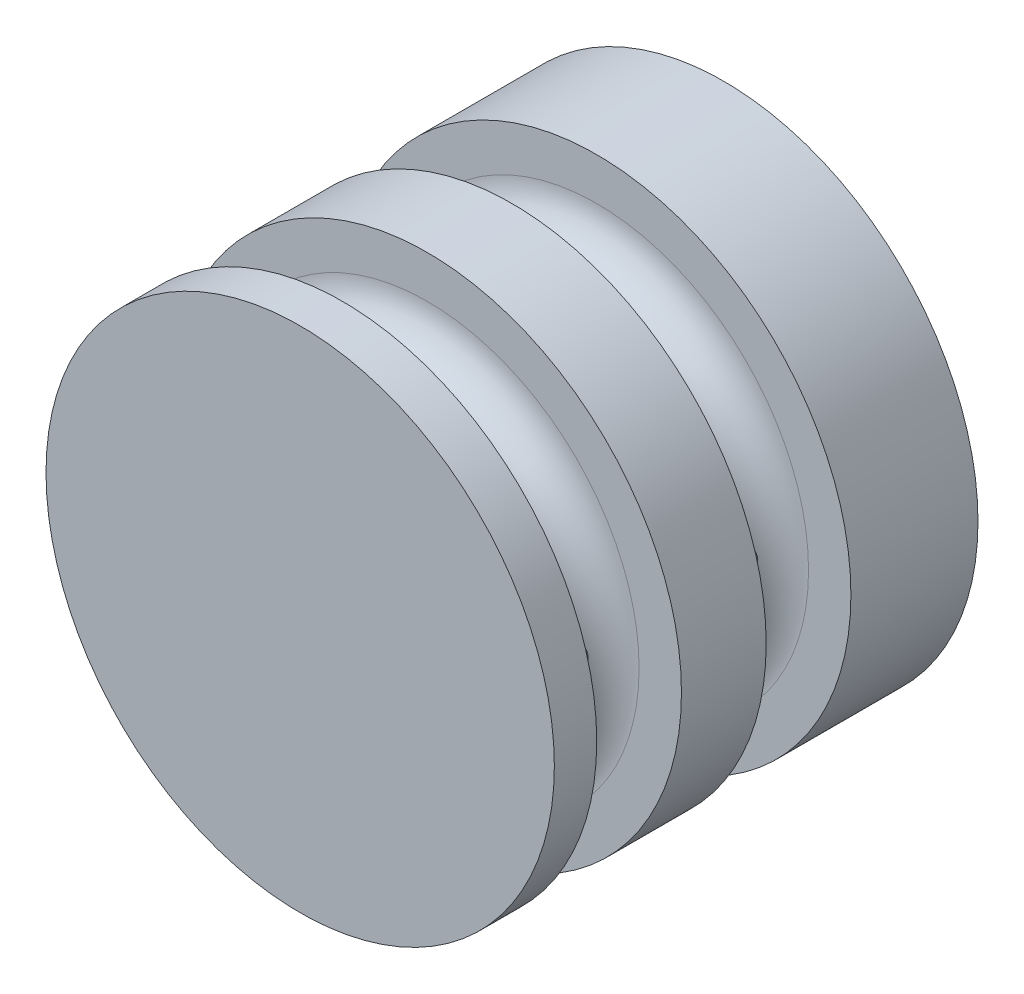
ISO-10303-21;
HEADER;
FILE_DESCRIPTION(('STEP AP214'),'2;1');
FILE_NAME('part.step','',(''),(''),'','','');
FILE_SCHEMA(('AUTOMOTIVE_DESIGN { 1 0 10303 214 1 1 1 1 }'));
ENDSEC;
DATA;
#1=APPLICATION_CONTEXT('core data for automotive mechanical design processes');
#2=APPLICATION_PROTOCOL_DEFINITION('international standard','automotive_design',2000,#1);
#3=PRODUCT_CONTEXT('',#1,'mechanical');
#4=PRODUCT('Part','Part','',(#3));
#5=PRODUCT_RELATED_PRODUCT_CATEGORY('part','',(#4));
#6=PRODUCT_DEFINITION_FORMATION('','',#4);
#7=PRODUCT_DEFINITION_CONTEXT('part definition',#1,'design');
#8=PRODUCT_DEFINITION('design','',#6,#7);
#9=PRODUCT_DEFINITION_SHAPE('','',#8);
#10=(LENGTH_UNIT() NAMED_UNIT(*) SI_UNIT(.MILLI.,.METRE.));
#11=(NAMED_UNIT(*) PLANE_ANGLE_UNIT() SI_UNIT($,.RADIAN.));
#12=(NAMED_UNIT(*) SI_UNIT($,.STERADIAN.) SOLID_ANGLE_UNIT());
#13=UNCERTAINTY_MEASURE_WITH_UNIT(LENGTH_MEASURE(1.E-05),#10,'distance_accuracy_value','');
#14=(GEOMETRIC_REPRESENTATION_CONTEXT(3) GLOBAL_UNCERTAINTY_ASSIGNED_CONTEXT((#13)) GLOBAL_UNIT_ASSIGNED_CONTEXT((#10,
#11,#12)) REPRESENTATION_CONTEXT('',''));
#15=CARTESIAN_POINT('',(0.,0.,0.));
#16=DIRECTION('',(0.,0.,1.));
#17=DIRECTION('',(1.,0.,0.));
#18=AXIS2_PLACEMENT_3D('',#15,#16,#17);
#19=CARTESIAN_POINT('',(0.,0.,-25.));
#20=DIRECTION('',(0.,0.,1.));
#21=DIRECTION('',(1.,0.,0.));
#22=AXIS2_PLACEMENT_3D('',#19,#20,#21);
#23=PLANE('',#22);
#24=CARTESIAN_POINT('',(0.,0.,-25.));
#25=DIRECTION('',(0.,0.,1.));
#26=DIRECTION('',(1.,0.,0.));
#27=AXIS2_PLACEMENT_3D('',#24,#25,#26);
#28=CIRCLE('',#27,3.5);
#29=CARTESIAN_POINT('',(3.5,0.,-25.));
#30=VERTEX_POINT('',#29);
#31=EDGE_CURVE('E220',#30,#30,#28,.T.);
#32=ORIENTED_EDGE('',*,*,#31,.T.);
#33=EDGE_LOOP('',(#32));
#34=FACE_BOUND('',#33,.T.);
#35=CARTESIAN_POINT('',(0.,7.,-25.));
#36=DIRECTION('',(0.,0.,-1.));
#37=DIRECTION('',(-1.,0.,0.));
#38=AXIS2_PLACEMENT_3D('',#35,#36,#37);
#39=CIRCLE('',#38,1.59999999999999);
#40=CARTESIAN_POINT('',(-1.59999999999999,7.,-25.));
#41=VERTEX_POINT('',#40);
#42=EDGE_CURVE('E87',#41,#41,#39,.T.);
#43=ORIENTED_EDGE('',*,*,#42,.F.);
#44=EDGE_LOOP('',(#43));
#45=FACE_BOUND('',#44,.T.);
#46=CARTESIAN_POINT('',(-7.,0.,-25.));
#47=DIRECTION('',(0.,0.,-1.));
#48=DIRECTION('',(-1.,0.,0.));
#49=AXIS2_PLACEMENT_3D('',#46,#47,#48);
#50=CIRCLE('',#49,1.59999999999999);
#51=CARTESIAN_POINT('',(-8.59999999999999,0.,-25.));
#52=VERTEX_POINT('',#51);
#53=EDGE_CURVE('E86',#52,#52,#50,.T.);
#54=ORIENTED_EDGE('',*,*,#53,.F.);
#55=EDGE_LOOP('',(#54));
#56=FACE_BOUND('',#55,.T.);
#57=CARTESIAN_POINT('',(0.,-7.,-25.));
#58=DIRECTION('',(0.,0.,-1.));
#59=DIRECTION('',(-1.,0.,0.));
#60=AXIS2_PLACEMENT_3D('',#57,#58,#59);
#61=CIRCLE('',#60,1.59999999999999);
#62=CARTESIAN_POINT('',(-1.59999999999999,-7.,-25.));
#63=VERTEX_POINT('',#62);
#64=EDGE_CURVE('E102',#63,#63,#61,.T.);
#65=ORIENTED_EDGE('',*,*,#64,.F.);
#66=EDGE_LOOP('',(#65));
#67=FACE_BOUND('',#66,.T.);
#68=CARTESIAN_POINT('',(7.,0.,-25.));
#69=DIRECTION('',(0.,0.,-1.));
#70=DIRECTION('',(-1.,0.,0.));
#71=AXIS2_PLACEMENT_3D('',#68,#69,#70);
#72=CIRCLE('',#71,1.59999999999999);
#73=CARTESIAN_POINT('',(5.40000000000001,0.,-25.));
#74=VERTEX_POINT('',#73);
#75=EDGE_CURVE('E110',#74,#74,#72,.T.);
#76=ORIENTED_EDGE('',*,*,#75,.F.);
#77=EDGE_LOOP('',(#76));
#78=FACE_BOUND('',#77,.T.);
#79=CARTESIAN_POINT('',(0.,0.,-25.));
#80=DIRECTION('',(0.,0.,1.));
#81=DIRECTION('',(1.,0.,0.));
#82=AXIS2_PLACEMENT_3D('',#79,#80,#81);
#83=CIRCLE('',#82,15.);
#84=CARTESIAN_POINT('',(15.,0.,-25.));
#85=VERTEX_POINT('',#84);
#86=EDGE_CURVE('E11',#85,#85,#83,.T.);
#87=ORIENTED_EDGE('',*,*,#86,.F.);
#88=EDGE_LOOP('',(#87));
#89=FACE_BOUND('',#88,.T.);
#90=ADVANCED_FACE('F47',(#34,#45,#56,#67,#78,#89),#23,.F.);
#91=CARTESIAN_POINT('',(0.,0.,0.));
#92=DIRECTION('',(0.,0.,1.));
#93=DIRECTION('',(1.,0.,0.));
#94=AXIS2_PLACEMENT_3D('',#91,#92,#93);
#95=CYLINDRICAL_SURFACE('',#94,15.);
#96=ORIENTED_EDGE('',*,*,#86,.T.);
#97=EDGE_LOOP('',(#96));
#98=FACE_BOUND('',#97,.T.);
#99=CARTESIAN_POINT('',(0.,0.,-17.5));
#100=DIRECTION('',(0.,0.,1.));
#101=DIRECTION('',(1.,0.,0.));
#102=AXIS2_PLACEMENT_3D('',#99,#100,#101);
#103=CIRCLE('',#102,15.);
#104=CARTESIAN_POINT('',(15.,0.,-17.5));
#105=VERTEX_POINT('',#104);
#106=EDGE_CURVE('E61',#105,#105,#103,.T.);
#107=ORIENTED_EDGE('',*,*,#106,.F.);
#108=EDGE_LOOP('',(#107));
#109=FACE_BOUND('',#108,.T.);
#110=ADVANCED_FACE('F201',(#98,#109),#95,.T.);
#111=CARTESIAN_POINT('',(0.,0.,-17.5));
#112=DIRECTION('',(0.,0.,1.));
#113=DIRECTION('',(1.,0.,0.));
#114=AXIS2_PLACEMENT_3D('',#111,#112,#113);
#115=PLANE('',#114);
#116=ORIENTED_EDGE('',*,*,#106,.T.);
#117=EDGE_LOOP('',(#116));
#118=FACE_BOUND('',#117,.T.);
#119=CARTESIAN_POINT('',(0.,0.,-17.5));
#120=DIRECTION('',(0.,0.,1.));
#121=DIRECTION('',(1.,0.,0.));
#122=AXIS2_PLACEMENT_3D('',#119,#120,#121);
#123=CIRCLE('',#122,12.5);
#124=CARTESIAN_POINT('',(12.5,0.,-17.5));
#125=VERTEX_POINT('',#124);
#126=EDGE_CURVE('E147',#125,#125,#123,.T.);
#127=ORIENTED_EDGE('',*,*,#126,.F.);
#128=EDGE_LOOP('',(#127));
#129=FACE_BOUND('',#128,.T.);
#130=ADVANCED_FACE('F197',(#118,#129),#115,.T.);
#131=CARTESIAN_POINT('',(0.,0.,-15.));
#132=DIRECTION('',(0.,0.,1.));
#133=DIRECTION('',(1.,0.,0.));
#134=AXIS2_PLACEMENT_3D('',#131,#132,#133);
#135=TOROIDAL_SURFACE('',#134,12.5,2.5);
#136=CARTESIAN_POINT('',(-10.331563461529,-0.762303138128262,-16.2918567744142));
#137=CARTESIAN_POINT('',(-10.3571768917839,-0.702863928352168,-16.3269303746499));
#138=CARTESIAN_POINT('',(-10.3813468920579,-0.640497040593573,-16.3582069846842));
#139=CARTESIAN_POINT('',(-10.4245730773328,-0.510382569111914,-16.4122579798436));
#140=CARTESIAN_POINT('',(-10.4436243288663,-0.442629875430599,-16.4350241708062));
#141=CARTESIAN_POINT('',(-10.4743540959138,-0.302243964609681,-16.4710321218813));
#142=CARTESIAN_POINT('',(-10.4859634604527,-0.22957171812525,-16.4841847045559));
#143=CARTESIAN_POINT('',(-10.4995837498731,-0.0822562940621653,-16.4995651765924));
#144=CARTESIAN_POINT('',(-10.5016112218422,-0.0076167382391645,-16.5018118995988));
#145=CARTESIAN_POINT('',(-10.4961115234413,0.131640892244681,-16.4956365135555));
#146=CARTESIAN_POINT('',(-10.489722452848,0.196368286283706,-16.4884854776984));
#147=CARTESIAN_POINT('',(-10.4702062729504,0.323394060495705,-16.4661459913901));
#148=CARTESIAN_POINT('',(-10.457071608093,0.385689632484336,-16.4509485277665));
#149=CARTESIAN_POINT('',(-10.4211670246832,0.523453579264165,-16.4080322349446));
#150=CARTESIAN_POINT('',(-10.3967327530326,0.597761677154352,-16.3780054985274));
#151=CARTESIAN_POINT('',(-10.3426855129699,0.739236612318296,-16.307592319013));
#152=CARTESIAN_POINT('',(-10.3130646512393,0.806392310372203,-16.2671900413139));
#153=CARTESIAN_POINT('',(-10.251113002849,0.934180039673199,-16.1762521831512));
#154=CARTESIAN_POINT('',(-10.2187422155484,0.994668372422415,-16.1255429387364));
#155=CARTESIAN_POINT('',(-10.1545592654337,1.10711433010181,-16.0151367367607));
#156=CARTESIAN_POINT('',(-10.1227469268653,1.15907468354865,-15.9554426656488));
#157=CARTESIAN_POINT('',(-10.0631785805986,1.25219248189157,-15.8294372498299));
#158=CARTESIAN_POINT('',(-10.0353305685515,1.29362349093601,-15.7633731903876));
#159=CARTESIAN_POINT('',(-9.98506610669139,1.3663177029197,-15.6239670286912));
#160=CARTESIAN_POINT('',(-9.96264372165722,1.39759202942915,-15.5506330042029));
#161=CARTESIAN_POINT('',(-9.92840994508656,1.44456780319142,-15.4097193506219));
#162=CARTESIAN_POINT('',(-9.91550412776364,1.4619131292107,-15.3429576279622));
#163=CARTESIAN_POINT('',(-9.89649935252837,1.48729393283197,-15.206749310848));
#164=CARTESIAN_POINT('',(-9.89039556812976,1.49533601184927,-15.1373046563571));
#165=CARTESIAN_POINT('',(-9.88562413360547,1.50163116566931,-14.997557335023));
#166=CARTESIAN_POINT('',(-9.88697274213881,1.49986283737152,-14.9272531263376));
#167=CARTESIAN_POINT('',(-9.89699688356039,1.48660245496729,-14.7880978607954));
#168=CARTESIAN_POINT('',(-9.90567495840769,1.47510702736732,-14.7192473165818));
#169=CARTESIAN_POINT('',(-9.92914975451083,1.4435037868733,-14.586696486354));
#170=CARTESIAN_POINT('',(-9.94377635074125,1.42363491953707,-14.5229076440803));
#171=CARTESIAN_POINT('',(-9.97789945931796,1.37621583002469,-14.3996714620731));
#172=CARTESIAN_POINT('',(-9.99739710704999,1.34866381682191,-14.3402251387115));
#173=CARTESIAN_POINT('',(-10.0428060711243,1.28251318372049,-14.2185994721005));
#174=CARTESIAN_POINT('',(-10.0692296247525,1.24291987511486,-14.1571553910749));
#175=CARTESIAN_POINT('',(-10.1246244885247,1.15592073588388,-14.0412997879019));
#176=CARTESIAN_POINT('',(-10.1535988876716,1.10850537055327,-13.986896994984));
#177=CARTESIAN_POINT('',(-10.2178589955819,0.99652617128886,-13.8755707577776));
#178=CARTESIAN_POINT('',(-10.25326523212,0.930423735338206,-13.8202558798899));
#179=CARTESIAN_POINT('',(-10.3212430812988,0.788734814970415,-13.7211888755136));
#180=CARTESIAN_POINT('',(-10.3538164024839,0.713154115060486,-13.6774297468078));
#181=CARTESIAN_POINT('',(-10.4052697381039,0.571546073371825,-13.6114904137481));
#182=CARTESIAN_POINT('',(-10.4255781550852,0.507277644186682,-13.5866644665982));
#183=CARTESIAN_POINT('',(-10.4598020811418,0.374403853464129,-13.5458213175514));
#184=CARTESIAN_POINT('',(-10.4737274926775,0.305805398853303,-13.5297904634703));
#185=CARTESIAN_POINT('',(-10.4933413170281,0.165244604693767,-13.5074216482966));
#186=CARTESIAN_POINT('',(-10.4989615322868,0.093259368557653,-13.5011639149822));
#187=CARTESIAN_POINT('',(-10.5007724073006,-0.050975000802327,-13.4991340940858));
#188=CARTESIAN_POINT('',(-10.4969654019663,-0.123224064256361,-13.5033594100886));
#189=CARTESIAN_POINT('',(-10.4815708208058,-0.256973355968861,-13.5208185382982));
#190=CARTESIAN_POINT('',(-10.4709475646886,-0.318740843095347,-13.5329383499724));
#191=CARTESIAN_POINT('',(-10.4441566887692,-0.439158348187076,-13.5643751660998));
#192=CARTESIAN_POINT('',(-10.4279845843008,-0.497805800068278,-13.5836979932383));
#193=CARTESIAN_POINT('',(-10.3843313907465,-0.633885385881376,-13.6378362011176));
#194=CARTESIAN_POINT('',(-10.3549135904181,-0.709459134970326,-13.675756933988));
#195=CARTESIAN_POINT('',(-10.2921020811355,-0.852131022824994,-13.7627130038453));
#196=CARTESIAN_POINT('',(-10.2587008795219,-0.919212683879295,-13.8117694484032));
#197=CARTESIAN_POINT('',(-10.1907683441847,-1.04531284296086,-13.9209323296037));
#198=CARTESIAN_POINT('',(-10.1562274552203,-1.10417942547862,-13.9812082952188));
#199=CARTESIAN_POINT('',(-10.0897996442004,-1.21154632115756,-14.1115910605403));
#200=CARTESIAN_POINT('',(-10.0579094920373,-1.26005936733357,-14.1816856072575));
#201=CARTESIAN_POINT('',(-10.0044656858484,-1.33862226314555,-14.3193032122536));
#202=CARTESIAN_POINT('',(-9.98207570272516,-1.3703710300187,-14.3855258072723));
#203=CARTESIAN_POINT('',(-9.94338544817422,-1.42421570531621,-14.5234723614847));
#204=CARTESIAN_POINT('',(-9.92708048129675,-1.44631905877878,-14.5951920271832));
#205=CARTESIAN_POINT('',(-9.9021829944501,-1.4797700569357,-14.7429902776557));
#206=CARTESIAN_POINT('',(-9.89364529617936,-1.49104127895957,-14.8190958756499));
#207=CARTESIAN_POINT('',(-9.88556191185001,-1.50171853160347,-14.9726045193793));
#208=CARTESIAN_POINT('',(-9.88601175417089,-1.50113046264039,-15.0500069007659));
#209=CARTESIAN_POINT('',(-9.89525501503698,-1.48890874483942,-15.1944102775657));
#210=CARTESIAN_POINT('',(-9.90308809656582,-1.47854633334317,-15.2615882465939));
#211=CARTESIAN_POINT('',(-9.92495696786831,-1.44917925907946,-15.3929519401722));
#212=CARTESIAN_POINT('',(-9.93899349759876,-1.43017356532022,-15.4571373067502));
#213=CARTESIAN_POINT('',(-9.97279639826611,-1.3833890744888,-15.5839553630601));
#214=CARTESIAN_POINT('',(-9.99278523701612,-1.35526495779673,-15.6463994040799));
#215=CARTESIAN_POINT('',(-10.0366894838481,-1.2915218262488,-15.7658752626714));
#216=CARTESIAN_POINT('',(-10.0606091914468,-1.25589459246433,-15.8229010448408));
#217=CARTESIAN_POINT('',(-10.1154827998263,-1.17072124482793,-15.9410974934628));
#218=CARTESIAN_POINT('',(-10.1469174307961,-1.11981874222938,-16.0010652967921));
#219=CARTESIAN_POINT('',(-10.2104978962667,-1.00964327219085,-16.1120820113834));
#220=CARTESIAN_POINT('',(-10.2426424704424,-0.950384267783482,-16.16314548902));
#221=CARTESIAN_POINT('',(-10.2935742413979,-0.847146849805474,-16.2388750791199));
#222=CARTESIAN_POINT('',(-10.3129499917981,-0.805498052709475,-16.266368528996));
#223=CARTESIAN_POINT('',(-10.331563461529,-0.762303138128262,-16.2918567744142));
#224=B_SPLINE_CURVE_WITH_KNOTS('',3,(#136,#137,#138,#139,#140,#141,#142,#143,#144,#145,#146,
#147,#148,#149,#150,#151,#152,#153,#154,#155,#156,#157,#158,#159,#160,#161,#162,#163,#164,#165,
#166,#167,#168,#169,#170,#171,#172,#173,#174,#175,#176,#177,#178,#179,#180,#181,#182,#183,#184,
#185,#186,#187,#188,#189,#190,#191,#192,#193,#194,#195,#196,#197,#198,#199,#200,#201,#202,#203,
#204,#205,#206,#207,#208,#209,#210,#211,#212,#213,#214,#215,#216,#217,#218,#219,#220,#221,#222,
#223),.UNSPECIFIED.,.T.,.F.,(4,2,2,2,2,2,2,2,2,2,2,2,2,2,2,2,2,2,2,2,2,2,2,2,2,2,2,2,2,2,2,2,2,
2,2,2,2,2,2,2,2,2,2,4),(0.,0.220723401165583,0.441658779341057,0.664618446502952,
0.887192940847715,1.08254921570473,1.27812478248468,1.52814194745065,1.77854296673455,
2.03357714491571,2.28852956547647,2.53595769823641,2.78311392732603,2.99272834554131,
3.20219393375606,3.4121166868418,3.62211227391609,3.82648277461998,4.0309009562404,
4.26323283026451,4.49585002693061,4.77421669385381,5.0524142951631,5.2670925746932,
5.48143667015977,5.697531242046,5.91357229751562,6.10428974355594,6.29516169493352,
6.5623054616247,6.82995988729564,7.1020465006924,7.3737965425374,7.60321284471147,
7.8324517519604,8.06329636005111,8.2940261176161,8.49836190294768,8.70272206834538,
8.91596194629585,9.12943663399417,9.38262946333812,9.6354041335815,9.79580546622601),.UNSPECIFIED.);
#225=CARTESIAN_POINT('',(-10.331563461529,-0.762303138128262,-16.2918567744142));
#226=VERTEX_POINT('',#225);
#227=EDGE_CURVE('E50',#226,#226,#224,.T.);
#228=ORIENTED_EDGE('',*,*,#227,.T.);
#229=EDGE_LOOP('',(#228));
#230=FACE_BOUND('',#229,.T.);
#231=CARTESIAN_POINT('',(10.2427946824222,-0.948244365596653,-16.1622532526168));
#232=CARTESIAN_POINT('',(10.2082411500436,-1.01433981081444,-16.1083301583064));
#233=CARTESIAN_POINT('',(10.1730575334327,-1.07569528584257,-16.0489061375201));
#234=CARTESIAN_POINT('',(10.1048142294204,-1.18807842905252,-15.9196792871587));
#235=CARTESIAN_POINT('',(10.0717584000047,-1.23908767918075,-15.8498583257076));
#236=CARTESIAN_POINT('',(10.0158550878251,-1.3222046793638,-15.7121800291361));
#237=CARTESIAN_POINT('',(9.99221947047483,-1.35601368146504,-15.645677128347));
#238=CARTESIAN_POINT('',(9.95099393368266,-1.41378314491133,-15.5068095644285));
#239=CARTESIAN_POINT('',(9.93339541649398,-1.43775762172652,-15.4344534203512));
#240=CARTESIAN_POINT('',(9.90597738733829,-1.47472635361232,-15.2848777459332));
#241=CARTESIAN_POINT('',(9.8962205530674,-1.4876321921303,-15.2076242527845));
#242=CARTESIAN_POINT('',(9.88598859622421,-1.50116109865113,-15.0514407540496));
#243=CARTESIAN_POINT('',(9.88550835955026,-1.50179093430147,-14.9725116962157));
#244=CARTESIAN_POINT('',(9.89332828433213,-1.49145859418785,-14.8261078759328));
#245=CARTESIAN_POINT('',(9.90051247602717,-1.48196980667682,-14.758460083783));
#246=CARTESIAN_POINT('',(9.92123278155917,-1.45420617563158,-14.626015260493));
#247=CARTESIAN_POINT('',(9.93477053168914,-1.43592906872718,-14.5612189684317));
#248=CARTESIAN_POINT('',(9.96756174520075,-1.39070318095859,-14.4337161449837));
#249=CARTESIAN_POINT('',(9.98699140820657,-1.36348454063413,-14.3711522258628));
#250=CARTESIAN_POINT('',(10.0298632764755,-1.30157528331154,-14.2513659639112));
#251=CARTESIAN_POINT('',(10.053306516144,-1.26688273949298,-14.1941450039929));
#252=CARTESIAN_POINT('',(10.1071533941428,-1.18395778381681,-14.0756742217616));
#253=CARTESIAN_POINT('',(10.1380489787678,-1.13441130747905,-14.0155682795412));
#254=CARTESIAN_POINT('',(10.2008745640139,-1.02689437052078,-13.9038650187743));
#255=CARTESIAN_POINT('',(10.2328064631852,-0.968907681261726,-13.852284510261));
#256=CARTESIAN_POINT('',(10.300152049578,-0.835037783184432,-13.7506458192142));
#257=CARTESIAN_POINT('',(10.3352887193489,-0.757777546937704,-13.7021960183826));
#258=CARTESIAN_POINT('',(10.39863700291,-0.593523526501868,-13.6193742741844));
#259=CARTESIAN_POINT('',(10.426867982891,-0.506557982165397,-13.5849627765376));
#260=CARTESIAN_POINT('',(10.46394322468,-0.354280872373694,-13.5410350939764));
#261=CARTESIAN_POINT('',(10.4761045261364,-0.291061442563461,-13.5270668162354));
#262=CARTESIAN_POINT('',(10.493367300983,-0.162432657375559,-13.5074074063408));
#263=CARTESIAN_POINT('',(10.4984782366199,-0.0970263580446901,-13.5017051798535));
#264=CARTESIAN_POINT('',(10.5009357250515,0.0342698116172571,-13.498951285389));
#265=CARTESIAN_POINT('',(10.4982643215974,0.100160449825574,-13.5019196231115));
#266=CARTESIAN_POINT('',(10.4855072922256,0.230291240287577,-13.5163356373433));
#267=CARTESIAN_POINT('',(10.4754154427584,0.294529960237751,-13.5277904315296));
#268=CARTESIAN_POINT('',(10.4493187794753,0.41881637912273,-13.5582538847252));
#269=CARTESIAN_POINT('',(10.4334044931409,0.478912329925263,-13.5771472145054));
#270=CARTESIAN_POINT('',(10.3972415906076,0.595119169189279,-13.6217001045565));
#271=CARTESIAN_POINT('',(10.3769917691006,0.651228943677838,-13.6473615468695));
#272=CARTESIAN_POINT('',(10.3292200589842,0.770254583986645,-13.710755394649));
#273=CARTESIAN_POINT('',(10.3010610761491,0.832167153078512,-13.7498876122434));
#274=CARTESIAN_POINT('',(10.2430977785469,0.949253075597682,-13.8362892814875));
#275=CARTESIAN_POINT('',(10.2132911576654,1.0044166172793,-13.8835703451241));
#276=CARTESIAN_POINT('',(10.1477160038267,1.11883907745372,-13.996986435896));
#277=CARTESIAN_POINT('',(10.1120726958984,1.17634542791541,-14.0649824851359));
#278=CARTESIAN_POINT('',(10.0453261749666,1.27920828965451,-14.2115744495622));
#279=CARTESIAN_POINT('',(10.0142174243881,1.32457967760565,-14.2901572066716));
#280=CARTESIAN_POINT('',(9.96663227339515,1.3920940154263,-14.4369920936311));
#281=CARTESIAN_POINT('',(9.94843525057851,1.41719048680462,-14.5033255278155));
#282=CARTESIAN_POINT('',(9.91849681275089,1.45795529235574,-14.6402068576103));
#283=CARTESIAN_POINT('',(9.90674846927485,1.47363374696795,-14.7107501394206));
#284=CARTESIAN_POINT('',(9.89088775658301,1.49471230215292,-14.8545984794064));
#285=CARTESIAN_POINT('',(9.88681418063774,1.50006018873259,-14.9279156675435));
#286=CARTESIAN_POINT('',(9.88690651598376,1.49993880500105,-15.0745414831379));
#287=CARTESIAN_POINT('',(9.89107244351457,1.4944695133699,-15.1478501105781));
#288=CARTESIAN_POINT('',(9.90651903539369,1.473936194766,-15.2864282819339));
#289=CARTESIAN_POINT('',(9.91722522350056,1.45964600265321,-15.3518813702235));
#290=CARTESIAN_POINT('',(9.94424229931069,1.42293267990787,-15.4792264090096));
#291=CARTESIAN_POINT('',(9.96055455258096,1.40050756763703,-15.541117487553));
#292=CARTESIAN_POINT('',(9.99911457142151,1.34615602935585,-15.6654772995268));
#293=CARTESIAN_POINT('',(10.0217523486195,1.3135779803896,-15.7275373114068));
#294=CARTESIAN_POINT('',(10.0704403567007,1.24087615584252,-15.8456009774843));
#295=CARTESIAN_POINT('',(10.0964931492117,1.2007467059592,-15.9016000271612));
#296=CARTESIAN_POINT('',(10.1556039394492,1.10516403379535,-16.0175032452229));
#297=CARTESIAN_POINT('',(10.189032929559,1.04824912025529,-16.0760149093696));
#298=CARTESIAN_POINT('',(10.2554391106971,0.925529961552004,-16.1832318985774));
#299=CARTESIAN_POINT('',(10.288416047156,0.859720917366793,-16.231931893959));
#300=CARTESIAN_POINT('',(10.3474694357121,0.726979076963326,-16.3141347620145));
#301=CARTESIAN_POINT('',(10.37390678676,0.660860385087075,-16.3486863468169));
#302=CARTESIAN_POINT('',(10.4210740768618,0.522513164453369,-16.4080557727233));
#303=CARTESIAN_POINT('',(10.4418139502895,0.450295561308901,-16.4328905889183));
#304=CARTESIAN_POINT('',(10.4718862701051,0.313995542223696,-16.4681502623833));
#305=CARTESIAN_POINT('',(10.4825725416833,0.250671386779209,-16.4803262242669));
#306=CARTESIAN_POINT('',(10.4967712631857,0.122212188566986,-16.4964098841533));
#307=CARTESIAN_POINT('',(10.5002911647778,0.057079098279454,-16.500326170807));
#308=CARTESIAN_POINT('',(10.4996703590278,-0.0731590497232138,-16.4996307353601));
#309=CARTESIAN_POINT('',(10.4955230583356,-0.138264035109977,-16.4950116733554));
#310=CARTESIAN_POINT('',(10.4801390495148,-0.266548728999606,-16.4775506316537));
#311=CARTESIAN_POINT('',(10.4688918502525,-0.329725443123951,-16.4646964829984));
#312=CARTESIAN_POINT('',(10.4373484516828,-0.467168006593533,-16.4275667041564));
#313=CARTESIAN_POINT('',(10.415545983808,-0.540546510647371,-16.4013156375841));
#314=CARTESIAN_POINT('',(10.3663129579175,-0.680732607609914,-16.3388444506618));
#315=CARTESIAN_POINT('',(10.3388838664456,-0.747541906041232,-16.3026269271671));
#316=CARTESIAN_POINT('',(10.2882644313937,-0.858662811479309,-16.231232266612));
#317=CARTESIAN_POINT('',(10.2656676039138,-0.904492082534491,-16.1979479737596));
#318=CARTESIAN_POINT('',(10.2427946824222,-0.948244365596653,-16.1622532526168));
#319=B_SPLINE_CURVE_WITH_KNOTS('',3,(#231,#232,#233,#234,#235,#236,#237,#238,#239,#240,#241,
#242,#243,#244,#245,#246,#247,#248,#249,#250,#251,#252,#253,#254,#255,#256,#257,#258,#259,#260,
#261,#262,#263,#264,#265,#266,#267,#268,#269,#270,#271,#272,#273,#274,#275,#276,#277,#278,#279,
#280,#281,#282,#283,#284,#285,#286,#287,#288,#289,#290,#291,#292,#293,#294,#295,#296,#297,#298,
#299,#300,#301,#302,#303,#304,#305,#306,#307,#308,#309,#310,#311,#312,#313,#314,#315,#316,#317,
#318),.UNSPECIFIED.,.T.,.F.,(4,2,2,2,2,2,2,2,2,2,2,2,2,2,2,2,2,2,2,2,2,2,2,2,2,2,2,2,2,2,2,2,2,
2,2,2,2,2,2,2,2,2,2,4),(0.,0.275928353076772,0.552343676215655,0.786177478603377,
1.01967687004981,1.25502453586131,1.490242452997,1.69535391677597,1.90051823389445,
2.11255197065552,2.32464043663478,2.57509769364751,2.82604304622512,3.11775268809575,
3.4086346366419,3.60544941312085,3.80199978802877,3.99900402400178,4.19617367673853,
4.39039966902212,4.58467972771946,4.81926917533973,5.05419571596494,5.3406151307939,
5.62668178766369,5.84545121431003,6.06398513256887,6.28362073044898,6.50325676121657,
6.70592584096477,6.90864432338526,7.12880974780339,7.34914127521272,7.61273885563526,
7.87647923797765,8.11305095249885,8.34920751342746,8.54444953488872,8.73948843771368,
8.9346951407238,9.13019096741447,9.37167407255854,9.6130943164609,9.79574677260082),.UNSPECIFIED.);
#320=CARTESIAN_POINT('',(10.2427946824222,-0.948244365596653,-16.1622532526168));
#321=VERTEX_POINT('',#320);
#322=EDGE_CURVE('E186',#321,#321,#319,.T.);
#323=ORIENTED_EDGE('',*,*,#322,.T.);
#324=EDGE_LOOP('',(#323));
#325=FACE_BOUND('',#324,.T.);
#326=CARTESIAN_POINT('',(0.,0.,-12.5));
#327=DIRECTION('',(0.,0.,1.));
#328=DIRECTION('',(1.,0.,0.));
#329=AXIS2_PLACEMENT_3D('',#326,#327,#328);
#330=CIRCLE('',#329,12.5);
#331=CARTESIAN_POINT('',(12.5,0.,-12.5));
#332=VERTEX_POINT('',#331);
#333=EDGE_CURVE('E143',#332,#332,#330,.T.);
#334=ORIENTED_EDGE('',*,*,#333,.F.);
#335=EDGE_LOOP('',(#334));
#336=FACE_BOUND('',#335,.T.);
#337=ORIENTED_EDGE('',*,*,#126,.T.);
#338=EDGE_LOOP('',(#337));
#339=FACE_BOUND('',#338,.T.);
#340=ADVANCED_FACE('F192',(#230,#325,#336,#339),#135,.F.);
#341=CARTESIAN_POINT('',(0.,0.,-12.5));
#342=DIRECTION('',(0.,0.,1.));
#343=DIRECTION('',(1.,0.,0.));
#344=AXIS2_PLACEMENT_3D('',#341,#342,#343);
#345=PLANE('',#344);
#346=CARTESIAN_POINT('',(0.,0.,-12.5));
#347=DIRECTION('',(0.,0.,1.));
#348=DIRECTION('',(1.,0.,0.));
#349=AXIS2_PLACEMENT_3D('',#346,#347,#348);
#350=CIRCLE('',#349,15.);
#351=CARTESIAN_POINT('',(15.,0.,-12.5));
#352=VERTEX_POINT('',#351);
#353=EDGE_CURVE('E139',#352,#352,#350,.T.);
#354=ORIENTED_EDGE('',*,*,#353,.F.);
#355=EDGE_LOOP('',(#354));
#356=FACE_BOUND('',#355,.T.);
#357=ORIENTED_EDGE('',*,*,#333,.T.);
#358=EDGE_LOOP('',(#357));
#359=FACE_BOUND('',#358,.T.);
#360=ADVANCED_FACE('F196',(#356,#359),#345,.F.);
#361=ORIENTED_EDGE('',*,*,#353,.T.);
#362=EDGE_LOOP('',(#361));
#363=FACE_BOUND('',#362,.T.);
#364=CARTESIAN_POINT('',(0.,0.,-7.5));
#365=DIRECTION('',(0.,0.,1.));
#366=DIRECTION('',(1.,0.,0.));
#367=AXIS2_PLACEMENT_3D('',#364,#365,#366);
#368=CIRCLE('',#367,15.);
#369=CARTESIAN_POINT('',(15.,0.,-7.5));
#370=VERTEX_POINT('',#369);
#371=EDGE_CURVE('E135',#370,#370,#368,.T.);
#372=ORIENTED_EDGE('',*,*,#371,.F.);
#373=EDGE_LOOP('',(#372));
#374=FACE_BOUND('',#373,.T.);
#375=ADVANCED_FACE('F208',(#363,#374),#95,.T.);
#376=CARTESIAN_POINT('',(0.,0.,-7.5));
#377=DIRECTION('',(0.,0.,1.));
#378=DIRECTION('',(1.,0.,0.));
#379=AXIS2_PLACEMENT_3D('',#376,#377,#378);
#380=PLANE('',#379);
#381=ORIENTED_EDGE('',*,*,#371,.T.);
#382=EDGE_LOOP('',(#381));
#383=FACE_BOUND('',#382,.T.);
#384=CARTESIAN_POINT('',(0.,0.,-7.5));
#385=DIRECTION('',(0.,0.,1.));
#386=DIRECTION('',(1.,0.,0.));
#387=AXIS2_PLACEMENT_3D('',#384,#385,#386);
#388=CIRCLE('',#387,12.5);
#389=CARTESIAN_POINT('',(12.5,0.,-7.5));
#390=VERTEX_POINT('',#389);
#391=EDGE_CURVE('E131',#390,#390,#388,.T.);
#392=ORIENTED_EDGE('',*,*,#391,.F.);
#393=EDGE_LOOP('',(#392));
#394=FACE_BOUND('',#393,.T.);
#395=ADVANCED_FACE('F369',(#383,#394),#380,.T.);
#396=CARTESIAN_POINT('',(0.,0.,-5.));
#397=DIRECTION('',(0.,0.,1.));
#398=DIRECTION('',(1.,0.,0.));
#399=AXIS2_PLACEMENT_3D('',#396,#397,#398);
#400=TOROIDAL_SURFACE('',#399,12.5,2.5);
#401=CARTESIAN_POINT('',(-10.2204557763644,-0.990174871886068,-6.12674474620013));
#402=CARTESIAN_POINT('',(-10.1862690787793,-1.05316992722244,-6.07138311878911));
#403=CARTESIAN_POINT('',(-10.1518632865451,-1.11146975496411,-6.01081962123318));
#404=CARTESIAN_POINT('',(-10.0858286414458,-1.2176967306686,-5.87994306058026));
#405=CARTESIAN_POINT('',(-10.0541959839109,-1.26563822666573,-5.80964370782413));
#406=CARTESIAN_POINT('',(-10.0012410564628,-1.343247190331,-5.67153521708703));
#407=CARTESIAN_POINT('',(-9.97908168529623,-1.37458890136094,-5.60499378080411));
#408=CARTESIAN_POINT('',(-9.94094743618773,-1.42754939966572,-5.46646361862394));
#409=CARTESIAN_POINT('',(-9.92496791250609,-1.44917549270317,-5.39447903351069));
#410=CARTESIAN_POINT('',(-9.90080298281216,-1.48160275568177,-5.24625416365188));
#411=CARTESIAN_POINT('',(-9.8926723246423,-1.49232791584843,-5.16998785729672));
#412=CARTESIAN_POINT('',(-9.88543593571969,-1.50188296112097,-5.01629481228827));
#413=CARTESIAN_POINT('',(-9.88632571628265,-1.50071876251986,-4.93886866993547));
#414=CARTESIAN_POINT('',(-9.89636564175025,-1.48743733467048,-4.79467409542517));
#415=CARTESIAN_POINT('',(-9.90454552641656,-1.47660643522098,-4.72771128847774));
#416=CARTESIAN_POINT('',(-9.92703712258513,-1.4463657897981,-4.59683821507693));
#417=CARTESIAN_POINT('',(-9.9413505932727,-1.42695358255324,-4.53292883023082));
#418=CARTESIAN_POINT('',(-9.97572617179868,-1.37928263750946,-4.40638787525977));
#419=CARTESIAN_POINT('',(-9.99603441131745,-1.35063892145682,-4.3439703150687));
#420=CARTESIAN_POINT('',(-10.0405039824265,-1.28587667773133,-4.22467176377683));
#421=CARTESIAN_POINT('',(-10.0646664418761,-1.24975596114198,-4.16779240118763));
#422=CARTESIAN_POINT('',(-10.1199975140255,-1.16349259388548,-4.04996548920929));
#423=CARTESIAN_POINT('',(-10.1516330708742,-1.11199141519762,-3.99023143142248));
#424=CARTESIAN_POINT('',(-10.2155856311786,-1.00042568329352,-3.87958218287155));
#425=CARTESIAN_POINT('',(-10.2479038942337,-0.940343858442985,-3.82868524927965));
#426=CARTESIAN_POINT('',(-10.315187207124,-0.802492190675525,-3.72945729535837));
#427=CARTESIAN_POINT('',(-10.3498130960212,-0.72342151137152,-3.68267911100625));
#428=CARTESIAN_POINT('',(-10.4112993565675,-0.555642186502108,-3.60365243977451));
#429=CARTESIAN_POINT('',(-10.4381848175717,-0.466965991984179,-3.57135681576821));
#430=CARTESIAN_POINT('',(-10.4720626128927,-0.313046184669754,-3.53164822367631));
#431=CARTESIAN_POINT('',(-10.4826970047134,-0.249814040027536,-3.5195323424366));
#432=CARTESIAN_POINT('',(-10.4968135860674,-0.121558600210403,-3.50354266795904));
#433=CARTESIAN_POINT('',(-10.5003047110423,-0.0565376460032955,-3.49965857743799));
#434=CARTESIAN_POINT('',(-10.4996525452094,0.0734860236839966,-3.50038929626014));
#435=CARTESIAN_POINT('',(-10.495500855129,0.138488640485504,-3.50501345596576));
#436=CARTESIAN_POINT('',(-10.4801336573722,0.266553993166881,-3.5224555537318));
#437=CARTESIAN_POINT('',(-10.4689098187567,0.329614349057667,-3.53528315565361));
#438=CARTESIAN_POINT('',(-10.4374225003678,0.466885822976617,-3.57234516675844));
#439=CARTESIAN_POINT('',(-10.4156493929995,0.540209354611759,-3.5985591323431));
#440=CARTESIAN_POINT('',(-10.3664478306523,0.680391299813795,-3.66097848041047));
#441=CARTESIAN_POINT('',(-10.3390120918084,0.747241222005158,-3.69719675197464));
#442=CARTESIAN_POINT('',(-10.2808423177824,0.874975434863797,-3.77923143008967));
#443=CARTESIAN_POINT('',(-10.2500600548703,0.935738691753771,-3.82520084077527));
#444=CARTESIAN_POINT('',(-10.1881494311819,1.04958512586122,-3.9256905928794));
#445=CARTESIAN_POINT('',(-10.157020832425,1.10266261950896,-3.98021720082429));
#446=CARTESIAN_POINT('',(-10.0909987468683,1.20985630082171,-4.10863871877147));
#447=CARTESIAN_POINT('',(-10.0565295521393,1.26221615273863,-4.18424234551336));
#448=CARTESIAN_POINT('',(-9.99455674816246,1.3530455596548,-4.34592557126481));
#449=CARTESIAN_POINT('',(-9.96703933259141,1.391542711915,-4.43198389534704));
#450=CARTESIAN_POINT('',(-9.92916817574181,1.44353932322836,-4.58667359617995));
#451=CARTESIAN_POINT('',(-9.91615969822398,1.46103248376792,-4.65331928603202));
#452=CARTESIAN_POINT('',(-9.89692063934132,1.48673627234896,-4.78931244664657));
#453=CARTESIAN_POINT('',(-9.89068333583408,1.49495610688477,-4.85865716692804));
#454=CARTESIAN_POINT('',(-9.88562546003713,1.50162966320202,-4.99825632113741));
#455=CARTESIAN_POINT('',(-9.88682241200503,1.50006030956797,-5.06851251467445));
#456=CARTESIAN_POINT('',(-9.89654279378898,1.48720440161462,-5.20762069207877));
#457=CARTESIAN_POINT('',(-9.90506911315602,1.47591401484429,-5.27647211116257));
#458=CARTESIAN_POINT('',(-9.92826108006552,1.44470795067983,-5.40907174968421));
#459=CARTESIAN_POINT('',(-9.94275705011285,1.42503016830346,-5.47290707148188));
#460=CARTESIAN_POINT('',(-9.97664270262363,1.3779820610032,-5.59626197251438));
#461=CARTESIAN_POINT('',(-9.99603351361993,1.3506099619462,-5.65578055242104));
#462=CARTESIAN_POINT('',(-10.0412108067011,1.28488007215388,-5.77749171811655));
#463=CARTESIAN_POINT('',(-10.0675073214633,1.24553802426398,-5.83896039982689));
#464=CARTESIAN_POINT('',(-10.122681319386,1.1590538040953,-5.95490084278813));
#465=CARTESIAN_POINT('',(-10.1515618854391,1.11190225609736,-6.00936405224898));
#466=CARTESIAN_POINT('',(-10.2156763805289,1.00050140017161,-6.12088302779658));
#467=CARTESIAN_POINT('',(-10.2510409590728,0.934713778370028,-6.17633535016395));
#468=CARTESIAN_POINT('',(-10.319029443236,0.793672421111946,-6.2757415563763));
#469=CARTESIAN_POINT('',(-10.3516548739095,0.718424012140536,-6.31970186774772));
#470=CARTESIAN_POINT('',(-10.4034202472392,0.577120442564078,-6.38620992064094));
#471=CARTESIAN_POINT('',(-10.4239430754096,0.512799751223873,-6.41134956656774));
#472=CARTESIAN_POINT('',(-10.4586169925639,0.379762313062716,-6.4527965544266));
#473=CARTESIAN_POINT('',(-10.4727778778829,0.311052512401119,-6.46911748362842));
#474=CARTESIAN_POINT('',(-10.4928546644488,0.170187964407654,-6.49203225712657));
#475=CARTESIAN_POINT('',(-10.4987010107084,0.0980093177634859,-6.49854407004519));
#476=CARTESIAN_POINT('',(-10.5009067647983,-0.0466689155141901,-6.50101659212791));
#477=CARTESIAN_POINT('',(-10.4972690442921,-0.119168398366298,-6.49698049507361));
#478=CARTESIAN_POINT('',(-10.4821372211152,-0.253238216292523,-6.4798271290059));
#479=CARTESIAN_POINT('',(-10.4716354519017,-0.315078136341438,-6.4678544789518));
#480=CARTESIAN_POINT('',(-10.4450545711588,-0.435661773252318,-6.43669188790743));
#481=CARTESIAN_POINT('',(-10.4289705976304,-0.494402739432403,-6.41749565407456));
#482=CARTESIAN_POINT('',(-10.3847542397093,-0.633019702766549,-6.36272804736805));
#483=CARTESIAN_POINT('',(-10.3544346284736,-0.710819719916629,-6.3236680576051));
#484=CARTESIAN_POINT('',(-10.2896428069456,-0.857430333944636,-6.23379002976401));
#485=CARTESIAN_POINT('',(-10.2551621950701,-0.926222138181647,-6.1829480052711));
#486=CARTESIAN_POINT('',(-10.2204557763644,-0.990174871886068,-6.12674474620013));
#487=B_SPLINE_CURVE_WITH_KNOTS('',3,(#401,#402,#403,#404,#405,#406,#407,#408,#409,#410,#411,
#412,#413,#414,#415,#416,#417,#418,#419,#420,#421,#422,#423,#424,#425,#426,#427,#428,#429,#430,
#431,#432,#433,#434,#435,#436,#437,#438,#439,#440,#441,#442,#443,#444,#445,#446,#447,#448,#449,
#450,#451,#452,#453,#454,#455,#456,#457,#458,#459,#460,#461,#462,#463,#464,#465,#466,#467,#468,
#469,#470,#471,#472,#473,#474,#475,#476,#477,#478,#479,#480,#481,#482,#483,#484,#485,#486),
.UNSPECIFIED.,.T.,.F.,(4,2,2,2,2,2,2,2,2,2,2,2,2,2,2,2,2,2,2,2,2,2,2,2,2,2,2,2,2,2,2,2,2,2,2,2,
2,2,2,2,2,2,4),(0.,0.271421599772473,0.542464789745132,0.771994694638661,1.00135171198739,
1.23229723469421,1.46312784163415,1.66717977842843,1.87129027895325,2.08534659397349,
2.29946566353546,2.55344063232182,2.80793421712097,3.10092554868138,3.39295621933972,
3.58789413726946,3.78258805985287,3.97749607418537,4.17263411907674,4.41389758115566,
4.65547333738713,4.90116462919929,5.14703669022193,5.44010495239703,5.73258651879566,
5.94206081924131,6.15132697152468,6.36108659939074,6.57092896144534,6.77517874400776,
6.97947566057463,7.21135523432703,7.4435152369856,7.72141709318686,7.99916318363434,
8.21448965323147,8.42948340976028,8.64626531781243,8.86298159448831,9.05376182667673,
9.24470864373778,9.51969169399673,9.79523956357459),.UNSPECIFIED.);
#488=CARTESIAN_POINT('',(-10.2204557763644,-0.990174871886068,-6.12674474620013));
#489=VERTEX_POINT('',#488);
#490=EDGE_CURVE('E162',#489,#489,#487,.T.);
#491=ORIENTED_EDGE('',*,*,#490,.F.);
#492=EDGE_LOOP('',(#491));
#493=FACE_BOUND('',#492,.T.);
#494=CARTESIAN_POINT('',(10.1435634480595,-1.12424481014233,-5.99301239039977));
#495=CARTESIAN_POINT('',(10.1779954820013,-1.06722775538513,-6.05756603029736));
#496=CARTESIAN_POINT('',(10.2135057436665,-1.00486279328584,-6.11698623540026));
#497=CARTESIAN_POINT('',(10.2831845482424,-0.870289130103892,-6.22476638634878));
#498=CARTESIAN_POINT('',(10.3173496408181,-0.798057001325074,-6.27309925276852));
#499=CARTESIAN_POINT('',(10.3744626501049,-0.65866842521061,-6.3495359662264));
#500=CARTESIAN_POINT('',(10.3983169776923,-0.593036943646254,-6.37972709538061));
#501=CARTESIAN_POINT('',(10.4398799990705,-0.456466898727969,-6.43070735251584));
#502=CARTESIAN_POINT('',(10.4576036582881,-0.385541780055329,-6.45151941370509));
#503=CARTESIAN_POINT('',(10.4824606873439,-0.250727201789306,-6.48025249391087));
#504=CARTESIAN_POINT('',(10.4907821318265,-0.187373665904552,-6.48963677210653));
#505=CARTESIAN_POINT('',(10.5001583426834,-0.0594557857620323,-6.50019185665979));
#506=CARTESIAN_POINT('',(10.5012171294128,0.00510786876329181,-6.50136720720123));
#507=CARTESIAN_POINT('',(10.4959251932791,0.133485212496684,-6.4954297423185));
#508=CARTESIAN_POINT('',(10.4895796038344,0.197299390347127,-6.48832266906334));
#509=CARTESIAN_POINT('',(10.4703342897854,0.32255946319123,-6.46629182279242));
#510=CARTESIAN_POINT('',(10.4574271160452,0.384002580918108,-6.45135916506991));
#511=CARTESIAN_POINT('',(10.4219316505939,0.520923286542776,-6.40896392111877));
#512=CARTESIAN_POINT('',(10.3976116541533,0.595204431780463,-6.37910628007132));
#513=CARTESIAN_POINT('',(10.3437717522108,0.736642145084787,-6.30905010627039));
#514=CARTESIAN_POINT('',(10.3142445723516,0.80378853291651,-6.26883707053655));
#515=CARTESIAN_POINT('',(10.2524659910531,0.931555142898041,-6.17832131603464));
#516=CARTESIAN_POINT('',(10.2201752060526,0.992036598982877,-6.12785045710603));
#517=CARTESIAN_POINT('',(10.1560825769886,1.10456126376204,-6.01790754522617));
#518=CARTESIAN_POINT('',(10.1242810806532,1.1565987014124,-5.95842938948649));
#519=CARTESIAN_POINT('',(10.0591601218804,1.25855963018488,-5.8212213577324));
#520=CARTESIAN_POINT('',(10.0263477124682,1.3069528368472,-5.74209134831021));
#521=CARTESIAN_POINT('',(9.96899859891061,1.3890254462133,-5.57384990115363));
#522=CARTESIAN_POINT('',(9.9444415366959,1.42274110597025,-5.48476375024371));
#523=CARTESIAN_POINT('',(9.91286830530792,1.4654912903039,-5.32696917477455));
#524=CARTESIAN_POINT('',(9.90281162552923,1.47887739623415,-5.26003429201026));
#525=CARTESIAN_POINT('',(9.88960330648149,1.49640092468359,-5.12430791660899));
#526=CARTESIAN_POINT('',(9.88644596058774,1.50054599077298,-5.05551800603366));
#527=CARTESIAN_POINT('',(9.88736250780839,1.49933729610584,-4.91801933512163));
#528=CARTESIAN_POINT('',(9.89144237020117,1.4939756942131,-4.84931068859051));
#529=CARTESIAN_POINT('',(9.90641941165289,1.47407060672077,-4.71399587085392));
#530=CARTESIAN_POINT('',(9.91732008792844,1.45952241086975,-4.6473907966214));
#531=CARTESIAN_POINT('',(9.9449758860302,1.42193034926206,-4.51760613291241));
#532=CARTESIAN_POINT('',(9.96175730577763,1.39884829524659,-4.45444342836016));
#533=CARTESIAN_POINT('',(9.99980839745786,1.34513860010029,-4.33290001654508));
#534=CARTESIAN_POINT('',(10.021079093194,1.31450923749807,-4.27452040431514));
#535=CARTESIAN_POINT('',(10.0703124023902,1.2411457386907,-4.15425841586261));
#536=CARTESIAN_POINT('',(10.0988012836879,1.19726119944011,-4.09329553662714));
#537=CARTESIAN_POINT('',(10.1577250258346,1.10144264238351,-3.97902174228406));
#538=CARTESIAN_POINT('',(10.1881628304098,1.04949627077214,-3.92572281689073));
#539=CARTESIAN_POINT('',(10.2544159919651,0.927803494489359,-3.81806782432783));
#540=CARTESIAN_POINT('',(10.2901742795236,0.856544536949567,-3.76537251073056));
#541=CARTESIAN_POINT('',(10.3571658720608,0.704308580023312,-3.67264825049274));
#542=CARTESIAN_POINT('',(10.3884058853895,0.623346321027804,-3.63260041909359));
#543=CARTESIAN_POINT('',(10.4341127598285,0.476753654478136,-3.57626419035464));
#544=CARTESIAN_POINT('',(10.4508268173343,0.413180636690043,-3.55646277452827));
#545=CARTESIAN_POINT('',(10.4775352532749,0.282660296558564,-3.52535192650124));
#546=CARTESIAN_POINT('',(10.4875402409886,0.215718482507088,-3.51402908352267));
#547=CARTESIAN_POINT('',(10.4994790981879,0.0797843479064782,-3.50056002948451));
#548=CARTESIAN_POINT('',(10.5013669505447,0.0107825637873805,-3.49846613690772));
#549=CARTESIAN_POINT('',(10.4966383712249,-0.126568620737933,-3.50376909738099));
#550=CARTESIAN_POINT('',(10.4900192578675,-0.194917808580261,-3.51116894317436));
#551=CARTESIAN_POINT('',(10.4700725936046,-0.323803032515007,-3.53401248351566));
#552=CARTESIAN_POINT('',(10.4572819816242,-0.384541662923899,-3.54881533801502));
#553=CARTESIAN_POINT('',(10.4266962024221,-0.502565186639671,-3.58534421886636));
#554=CARTESIAN_POINT('',(10.4088974191976,-0.559847548022692,-3.60707524901792));
#555=CARTESIAN_POINT('',(10.3611085556791,-0.69497694394602,-3.66782923378979));
#556=CARTESIAN_POINT('',(10.3292181066083,-0.770630632032698,-3.7102437208766));
#557=CARTESIAN_POINT('',(10.2622954879419,-0.912755563065269,-3.8065706241696));
#558=CARTESIAN_POINT('',(10.2272570077711,-0.979207651239609,-3.86050644818194));
#559=CARTESIAN_POINT('',(10.1571629757093,-1.10301873457405,-3.97978650375862));
#560=CARTESIAN_POINT('',(10.1221136537055,-1.16024199008519,-4.04527571538622));
#561=CARTESIAN_POINT('',(10.0560045458106,-1.26321042271263,-4.1864260970691));
#562=CARTESIAN_POINT('',(10.0249377635699,-1.308975867081,-4.26206893731873));
#563=CARTESIAN_POINT('',(9.97596382252051,-1.37905331911498,-4.4056975920094));
#564=CARTESIAN_POINT('',(9.95666343325543,-1.40584874820682,-4.47199247153341));
#565=CARTESIAN_POINT('',(9.92442910476811,-1.44996699805514,-4.6091405941818));
#566=CARTESIAN_POINT('',(9.91148979813852,-1.46729780632225,-4.67998993701863));
#567=CARTESIAN_POINT('',(9.89327942347509,-1.49155793698357,-4.8248607934896));
#568=CARTESIAN_POINT('',(9.88805140277649,-1.49842887518267,-4.8988977578255));
#569=CARTESIAN_POINT('',(9.88603480252454,-1.5010882580347,-5.04727873770776));
#570=CARTESIAN_POINT('',(9.8892440361043,-1.49687957443406,-5.12162266870398));
#571=CARTESIAN_POINT('',(9.90306007769604,-1.47854597776457,-5.26163008090273));
#572=CARTESIAN_POINT('',(9.91299442899148,-1.46532175823021,-5.32748357988203));
#573=CARTESIAN_POINT('',(9.9386267262998,-1.43061314916389,-5.45581777813239));
#574=CARTESIAN_POINT('',(9.95432889748701,-1.40912270372297,-5.51829596626054));
#575=CARTESIAN_POINT('',(9.99161084612552,-1.35685223347501,-5.64334424616294));
#576=CARTESIAN_POINT('',(10.01354610522,-1.32549122770791,-5.70556184906991));
#577=CARTESIAN_POINT('',(10.0609472895088,-1.25528420080684,-5.82401266426461));
#578=CARTESIAN_POINT('',(10.0864087072886,-1.21644771110122,-5.88025335702655));
#579=CARTESIAN_POINT('',(10.122925654495,-1.15809656871883,-5.95367166846837));
#580=CARTESIAN_POINT('',(10.1331956718201,-1.14141312690659,-5.97357474419431));
#581=CARTESIAN_POINT('',(10.1435634480595,-1.12424481014233,-5.99301239039977));
#582=B_SPLINE_CURVE_WITH_KNOTS('',3,(#494,#495,#496,#497,#498,#499,#500,#501,#502,#503,#504,
#505,#506,#507,#508,#509,#510,#511,#512,#513,#514,#515,#516,#517,#518,#519,#520,#521,#522,#523,
#524,#525,#526,#527,#528,#529,#530,#531,#532,#533,#534,#535,#536,#537,#538,#539,#540,#541,#542,
#543,#544,#545,#546,#547,#548,#549,#550,#551,#552,#553,#554,#555,#556,#557,#558,#559,#560,#561,
#562,#563,#564,#565,#566,#567,#568,#569,#570,#571,#572,#573,#574,#575,#576,#577,#578,#579,#580,
#581),.UNSPECIFIED.,.T.,.F.,(4,2,2,2,2,2,2,2,2,2,2,2,2,2,2,2,2,2,2,2,2,2,2,2,2,2,2,2,2,2,2,2,2,
2,2,2,2,2,2,2,2,2,2,4),(0.,0.278204559883978,0.557081531682719,0.784471734878139,
1.01130287787432,1.20418181494295,1.39695397230769,1.58959256102929,1.78245033557921,
2.03211009656415,2.28212143195836,2.53662009753726,2.79129197361738,3.08476890026037,
3.37751669714723,3.5836113578685,3.78953548752348,3.99562954320723,4.20182935559823,
4.40896328805406,4.6161445096517,4.85627499272025,5.09677714841416,5.38218472128187,
5.66716409670879,5.87232202525702,6.07715476073346,6.28314720197565,6.48920459487063,
6.67989939581331,6.87073223720277,7.14649376316886,7.4228209728087,7.70290072093973,
7.98248149042262,8.20378066939607,8.42489279682629,8.64723464529399,8.86951887026572,
9.07233651788094,9.27530303534287,9.49366475433631,9.71174987916651,9.79551962191611),.UNSPECIFIED.);
#583=CARTESIAN_POINT('',(10.1435634480595,-1.12424481014233,-5.99301239039977));
#584=VERTEX_POINT('',#583);
#585=EDGE_CURVE('E118',#584,#584,#582,.T.);
#586=ORIENTED_EDGE('',*,*,#585,.F.);
#587=EDGE_LOOP('',(#586));
#588=FACE_BOUND('',#587,.T.);
#589=ORIENTED_EDGE('',*,*,#391,.T.);
#590=EDGE_LOOP('',(#589));
#591=FACE_BOUND('',#590,.T.);
#592=CARTESIAN_POINT('',(0.,0.,-2.5));
#593=DIRECTION('',(0.,0.,1.));
#594=DIRECTION('',(1.,0.,0.));
#595=AXIS2_PLACEMENT_3D('',#592,#593,#594);
#596=CIRCLE('',#595,12.5);
#597=CARTESIAN_POINT('',(12.5,0.,-2.5));
#598=VERTEX_POINT('',#597);
#599=EDGE_CURVE('E127',#598,#598,#596,.T.);
#600=ORIENTED_EDGE('',*,*,#599,.F.);
#601=EDGE_LOOP('',(#600));
#602=FACE_BOUND('',#601,.T.);
#603=ADVANCED_FACE('F166',(#493,#588,#591,#602),#400,.F.);
#604=CARTESIAN_POINT('',(0.,0.,-2.5));
#605=DIRECTION('',(0.,0.,1.));
#606=DIRECTION('',(1.,0.,0.));
#607=AXIS2_PLACEMENT_3D('',#604,#605,#606);
#608=PLANE('',#607);
#609=CARTESIAN_POINT('',(0.,0.,-2.5));
#610=DIRECTION('',(0.,0.,1.));
#611=DIRECTION('',(1.,0.,0.));
#612=AXIS2_PLACEMENT_3D('',#609,#610,#611);
#613=CIRCLE('',#612,15.);
#614=CARTESIAN_POINT('',(15.,0.,-2.5));
#615=VERTEX_POINT('',#614);
#616=EDGE_CURVE('E123',#615,#615,#613,.T.);
#617=ORIENTED_EDGE('',*,*,#616,.F.);
#618=EDGE_LOOP('',(#617));
#619=FACE_BOUND('',#618,.T.);
#620=ORIENTED_EDGE('',*,*,#599,.T.);
#621=EDGE_LOOP('',(#620));
#622=FACE_BOUND('',#621,.T.);
#623=ADVANCED_FACE('F352',(#619,#622),#608,.F.);
#624=ORIENTED_EDGE('',*,*,#616,.T.);
#625=EDGE_LOOP('',(#624));
#626=FACE_BOUND('',#625,.T.);
#627=CARTESIAN_POINT('',(0.,0.,0.));
#628=DIRECTION('',(0.,0.,1.));
#629=DIRECTION('',(1.,0.,0.));
#630=AXIS2_PLACEMENT_3D('',#627,#628,#629);
#631=CIRCLE('',#630,15.);
#632=CARTESIAN_POINT('',(15.,0.,0.));
#633=VERTEX_POINT('',#632);
#634=EDGE_CURVE('E119',#633,#633,#631,.T.);
#635=ORIENTED_EDGE('',*,*,#634,.F.);
#636=EDGE_LOOP('',(#635));
#637=FACE_BOUND('',#636,.T.);
#638=ADVANCED_FACE('F209',(#626,#637),#95,.T.);
#639=CARTESIAN_POINT('',(0.,0.,0.));
#640=DIRECTION('',(0.,0.,-1.));
#641=DIRECTION('',(-1.,0.,0.));
#642=AXIS2_PLACEMENT_3D('',#639,#640,#641);
#643=PLANE('',#642);
#644=ORIENTED_EDGE('',*,*,#634,.T.);
#645=EDGE_LOOP('',(#644));
#646=FACE_BOUND('',#645,.T.);
#647=ADVANCED_FACE('F175',(#646),#643,.F.);
#648=CARTESIAN_POINT('',(-15.,0.,-5.));
#649=DIRECTION('',(1.,0.,0.));
#650=DIRECTION('',(0.,0.,-1.));
#651=AXIS2_PLACEMENT_3D('',#648,#649,#650);
#652=CYLINDRICAL_SURFACE('',#651,1.5);
#653=ORIENTED_EDGE('',*,*,#490,.T.);
#654=EDGE_LOOP('',(#653));
#655=FACE_BOUND('',#654,.T.);
#656=ORIENTED_EDGE('',*,*,#585,.T.);
#657=EDGE_LOOP('',(#656));
#658=FACE_BOUND('',#657,.T.);
#659=ADVANCED_FACE('F170',(#655,#658),#652,.F.);
#660=CARTESIAN_POINT('',(-15.,0.,-15.));
#661=DIRECTION('',(1.,0.,0.));
#662=DIRECTION('',(0.,0.,-1.));
#663=AXIS2_PLACEMENT_3D('',#660,#661,#662);
#664=CYLINDRICAL_SURFACE('',#663,1.5);
#665=ORIENTED_EDGE('',*,*,#322,.F.);
#666=EDGE_LOOP('',(#665));
#667=FACE_BOUND('',#666,.T.);
#668=ORIENTED_EDGE('',*,*,#227,.F.);
#669=EDGE_LOOP('',(#668));
#670=FACE_BOUND('',#669,.T.);
#671=ADVANCED_FACE('F174',(#667,#670),#664,.F.);
#672=CARTESIAN_POINT('',(7.,0.,-20.));
#673=DIRECTION('',(0.,0.,-1.));
#674=DIRECTION('',(-1.,0.,0.));
#675=AXIS2_PLACEMENT_3D('',#672,#673,#674);
#676=CONICAL_SURFACE('',#675,1.6,1.02974425867665);
#677=CARTESIAN_POINT('',(7.,0.,-19.0386230095559));
#678=VERTEX_POINT('',#677);
#679=VERTEX_LOOP('',#678);
#680=FACE_BOUND('',#679,.T.);
#681=CARTESIAN_POINT('',(7.,0.,-20.));
#682=DIRECTION('',(0.,0.,-1.));
#683=DIRECTION('',(-1.,0.,0.));
#684=AXIS2_PLACEMENT_3D('',#681,#682,#683);
#685=CIRCLE('',#684,1.6);
#686=CARTESIAN_POINT('',(5.4,0.,-20.));
#687=VERTEX_POINT('',#686);
#688=EDGE_CURVE('E114',#687,#687,#685,.T.);
#689=ORIENTED_EDGE('',*,*,#688,.T.);
#690=EDGE_LOOP('',(#689));
#691=FACE_BOUND('',#690,.T.);
#692=ADVANCED_FACE('F177',(#680,#691),#676,.F.);
#693=CARTESIAN_POINT('',(7.,0.,-25.));
#694=DIRECTION('',(0.,0.,-1.));
#695=DIRECTION('',(-1.,0.,0.));
#696=AXIS2_PLACEMENT_3D('',#693,#694,#695);
#697=CYLINDRICAL_SURFACE('',#696,1.59999999999999);
#698=ORIENTED_EDGE('',*,*,#688,.F.);
#699=EDGE_LOOP('',(#698));
#700=FACE_BOUND('',#699,.T.);
#701=ORIENTED_EDGE('',*,*,#75,.T.);
#702=EDGE_LOOP('',(#701));
#703=FACE_BOUND('',#702,.T.);
#704=ADVANCED_FACE('F233',(#700,#703),#697,.F.);
#705=CARTESIAN_POINT('',(0.,-7.,-20.));
#706=DIRECTION('',(0.,0.,-1.));
#707=DIRECTION('',(-1.,0.,0.));
#708=AXIS2_PLACEMENT_3D('',#705,#706,#707);
#709=CONICAL_SURFACE('',#708,1.6,1.02974425867665);
#710=CARTESIAN_POINT('',(0.,-7.,-19.0386230095559));
#711=VERTEX_POINT('',#710);
#712=VERTEX_LOOP('',#711);
#713=FACE_BOUND('',#712,.T.);
#714=CARTESIAN_POINT('',(0.,-7.,-20.));
#715=DIRECTION('',(0.,0.,-1.));
#716=DIRECTION('',(-1.,0.,0.));
#717=AXIS2_PLACEMENT_3D('',#714,#715,#716);
#718=CIRCLE('',#717,1.6);
#719=CARTESIAN_POINT('',(-1.6,-7.,-20.));
#720=VERTEX_POINT('',#719);
#721=EDGE_CURVE('E106',#720,#720,#718,.T.);
#722=ORIENTED_EDGE('',*,*,#721,.T.);
#723=EDGE_LOOP('',(#722));
#724=FACE_BOUND('',#723,.T.);
#725=ADVANCED_FACE('F235',(#713,#724),#709,.F.);
#726=CARTESIAN_POINT('',(0.,-7.,-25.));
#727=DIRECTION('',(0.,0.,-1.));
#728=DIRECTION('',(-1.,0.,0.));
#729=AXIS2_PLACEMENT_3D('',#726,#727,#728);
#730=CYLINDRICAL_SURFACE('',#729,1.59999999999999);
#731=ORIENTED_EDGE('',*,*,#721,.F.);
#732=EDGE_LOOP('',(#731));
#733=FACE_BOUND('',#732,.T.);
#734=ORIENTED_EDGE('',*,*,#64,.T.);
#735=EDGE_LOOP('',(#734));
#736=FACE_BOUND('',#735,.T.);
#737=ADVANCED_FACE('F241',(#733,#736),#730,.F.);
#738=CARTESIAN_POINT('',(-7.,0.,-20.));
#739=DIRECTION('',(0.,0.,-1.));
#740=DIRECTION('',(-1.,0.,0.));
#741=AXIS2_PLACEMENT_3D('',#738,#739,#740);
#742=CONICAL_SURFACE('',#741,1.6,1.02974425867665);
#743=CARTESIAN_POINT('',(-7.,0.,-19.0386230095559));
#744=VERTEX_POINT('',#743);
#745=VERTEX_LOOP('',#744);
#746=FACE_BOUND('',#745,.T.);
#747=CARTESIAN_POINT('',(-7.,0.,-20.));
#748=DIRECTION('',(0.,0.,-1.));
#749=DIRECTION('',(-1.,0.,0.));
#750=AXIS2_PLACEMENT_3D('',#747,#748,#749);
#751=CIRCLE('',#750,1.6);
#752=CARTESIAN_POINT('',(-8.6,0.,-20.));
#753=VERTEX_POINT('',#752);
#754=EDGE_CURVE('E92',#753,#753,#751,.T.);
#755=ORIENTED_EDGE('',*,*,#754,.T.);
#756=EDGE_LOOP('',(#755));
#757=FACE_BOUND('',#756,.T.);
#758=ADVANCED_FACE('F247',(#746,#757),#742,.F.);
#759=CARTESIAN_POINT('',(-7.,0.,-25.));
#760=DIRECTION('',(0.,0.,-1.));
#761=DIRECTION('',(-1.,0.,0.));
#762=AXIS2_PLACEMENT_3D('',#759,#760,#761);
#763=CYLINDRICAL_SURFACE('',#762,1.59999999999999);
#764=ORIENTED_EDGE('',*,*,#754,.F.);
#765=EDGE_LOOP('',(#764));
#766=FACE_BOUND('',#765,.T.);
#767=ORIENTED_EDGE('',*,*,#53,.T.);
#768=EDGE_LOOP('',(#767));
#769=FACE_BOUND('',#768,.T.);
#770=ADVANCED_FACE('F79',(#766,#769),#763,.F.);
#771=CARTESIAN_POINT('',(0.,7.,-20.));
#772=DIRECTION('',(0.,0.,-1.));
#773=DIRECTION('',(-1.,0.,0.));
#774=AXIS2_PLACEMENT_3D('',#771,#772,#773);
#775=CONICAL_SURFACE('',#774,1.6,1.02974425867665);
#776=CARTESIAN_POINT('',(0.,7.,-19.0386230095559));
#777=VERTEX_POINT('',#776);
#778=VERTEX_LOOP('',#777);
#779=FACE_BOUND('',#778,.T.);
#780=CARTESIAN_POINT('',(0.,7.,-20.));
#781=DIRECTION('',(0.,0.,-1.));
#782=DIRECTION('',(-1.,0.,0.));
#783=AXIS2_PLACEMENT_3D('',#780,#781,#782);
#784=CIRCLE('',#783,1.6);
#785=CARTESIAN_POINT('',(-1.6,7.,-20.));
#786=VERTEX_POINT('',#785);
#787=EDGE_CURVE('E83',#786,#786,#784,.T.);
#788=ORIENTED_EDGE('',*,*,#787,.T.);
#789=EDGE_LOOP('',(#788));
#790=FACE_BOUND('',#789,.T.);
#791=ADVANCED_FACE('F75',(#779,#790),#775,.F.);
#792=CARTESIAN_POINT('',(0.,7.,-25.));
#793=DIRECTION('',(0.,0.,-1.));
#794=DIRECTION('',(-1.,0.,0.));
#795=AXIS2_PLACEMENT_3D('',#792,#793,#794);
#796=CYLINDRICAL_SURFACE('',#795,1.59999999999999);
#797=ORIENTED_EDGE('',*,*,#787,.F.);
#798=EDGE_LOOP('',(#797));
#799=FACE_BOUND('',#798,.T.);
#800=ORIENTED_EDGE('',*,*,#42,.T.);
#801=EDGE_LOOP('',(#800));
#802=FACE_BOUND('',#801,.T.);
#803=ADVANCED_FACE('F78',(#799,#802),#796,.F.);
#804=CARTESIAN_POINT('',(0.,0.,-20.));
#805=DIRECTION('',(0.,0.,-1.));
#806=DIRECTION('',(-1.,0.,0.));
#807=AXIS2_PLACEMENT_3D('',#804,#805,#806);
#808=CYLINDRICAL_SURFACE('',#807,3.5);
#809=CARTESIAN_POINT('',(0.,0.,-20.));
#810=DIRECTION('',(0.,0.,1.));
#811=DIRECTION('',(1.,0.,0.));
#812=AXIS2_PLACEMENT_3D('',#809,#810,#811);
#813=CIRCLE('',#812,3.5);
#814=CARTESIAN_POINT('',(3.5,0.,-20.));
#815=VERTEX_POINT('',#814);
#816=EDGE_CURVE('E95',#815,#815,#813,.T.);
#817=ORIENTED_EDGE('',*,*,#816,.T.);
#818=EDGE_LOOP('',(#817));
#819=FACE_BOUND('',#818,.T.);
#820=ORIENTED_EDGE('',*,*,#31,.F.);
#821=EDGE_LOOP('',(#820));
#822=FACE_BOUND('',#821,.T.);
#823=ADVANCED_FACE('F256',(#819,#822),#808,.F.);
#824=CARTESIAN_POINT('',(0.,0.,-20.));
#825=DIRECTION('',(0.,0.,1.));
#826=DIRECTION('',(1.,0.,0.));
#827=AXIS2_PLACEMENT_3D('',#824,#825,#826);
#828=PLANE('',#827);
#829=ORIENTED_EDGE('',*,*,#816,.F.);
#830=EDGE_LOOP('',(#829));
#831=FACE_BOUND('',#830,.T.);
#832=ADVANCED_FACE('F258',(#831),#828,.F.);
#833=CLOSED_SHELL('',(#90,#110,#130,#340,#360,#375,#395,#603,#623,#638,#647,#659,#671,#692,#704,
#725,#737,#758,#770,#791,#803,#823,#832));
#834=MANIFOLD_SOLID_BREP('B2',#833);
#835=ADVANCED_BREP_SHAPE_REPRESENTATION('',(#18,#834),#14);
#836=SHAPE_DEFINITION_REPRESENTATION(#9,#835);
ENDSEC;
END-ISO-10303-21;
